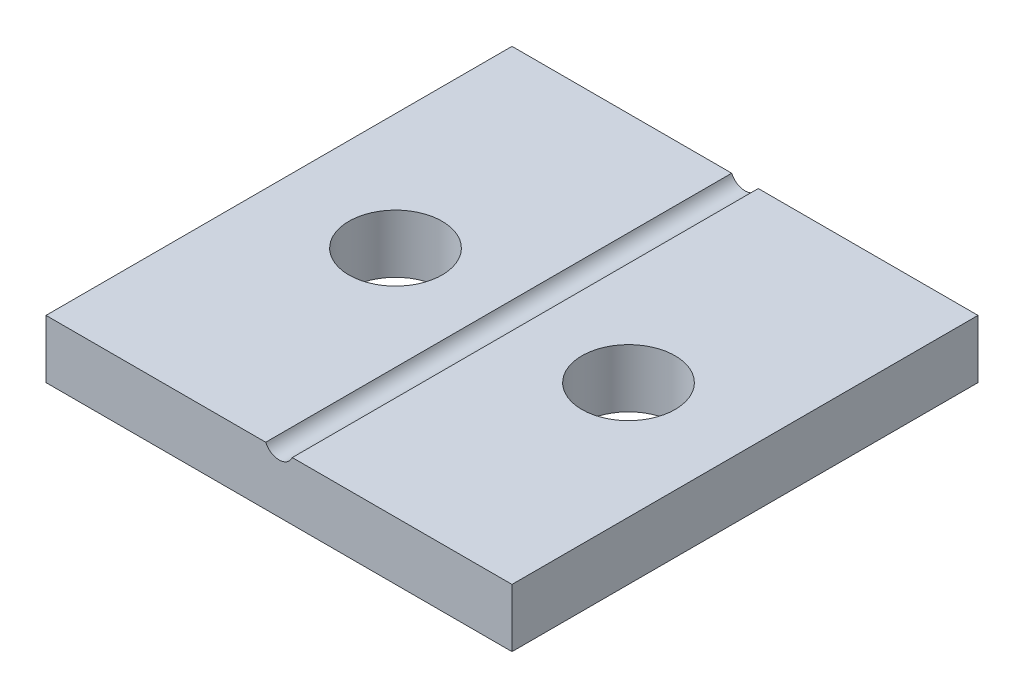
ISO-10303-21;
HEADER;
FILE_DESCRIPTION(('STEP AP214'),'2;1');
FILE_NAME('part.step','',(''),(''),'','','');
FILE_SCHEMA(('AUTOMOTIVE_DESIGN { 1 0 10303 214 1 1 1 1 }'));
ENDSEC;
DATA;
#1=APPLICATION_CONTEXT('core data for automotive mechanical design processes');
#2=APPLICATION_PROTOCOL_DEFINITION('international standard','automotive_design',2000,#1);
#3=PRODUCT_CONTEXT('',#1,'mechanical');
#4=PRODUCT('Part','Part','',(#3));
#5=PRODUCT_RELATED_PRODUCT_CATEGORY('part','',(#4));
#6=PRODUCT_DEFINITION_FORMATION('','',#4);
#7=PRODUCT_DEFINITION_CONTEXT('part definition',#1,'design');
#8=PRODUCT_DEFINITION('design','',#6,#7);
#9=PRODUCT_DEFINITION_SHAPE('','',#8);
#10=(LENGTH_UNIT() NAMED_UNIT(*) SI_UNIT(.MILLI.,.METRE.));
#11=(NAMED_UNIT(*) PLANE_ANGLE_UNIT() SI_UNIT($,.RADIAN.));
#12=(NAMED_UNIT(*) SI_UNIT($,.STERADIAN.) SOLID_ANGLE_UNIT());
#13=UNCERTAINTY_MEASURE_WITH_UNIT(LENGTH_MEASURE(1.E-05),#10,'distance_accuracy_value','');
#14=(GEOMETRIC_REPRESENTATION_CONTEXT(3) GLOBAL_UNCERTAINTY_ASSIGNED_CONTEXT((#13)) GLOBAL_UNIT_ASSIGNED_CONTEXT((#10,
#11,#12)) REPRESENTATION_CONTEXT('',''));
#15=CARTESIAN_POINT('',(0.,0.,0.));
#16=DIRECTION('',(0.,0.,1.));
#17=DIRECTION('',(1.,0.,0.));
#18=AXIS2_PLACEMENT_3D('',#15,#16,#17);
#19=CARTESIAN_POINT('',(0.,2.5,0.));
#20=DIRECTION('',(0.,1.,0.));
#21=DIRECTION('',(0.,0.,1.));
#22=AXIS2_PLACEMENT_3D('',#19,#20,#21);
#23=PLANE('',#22);
#24=CARTESIAN_POINT('',(-55.7547169811321,2.5,-42.0754716981132));
#25=DIRECTION('',(0.,1.,0.));
#26=DIRECTION('',(0.,0.,1.));
#27=AXIS2_PLACEMENT_3D('',#24,#25,#26);
#28=CIRCLE('',#27,2.);
#29=CARTESIAN_POINT('',(-55.7547169811321,2.5,-40.0754716981132));
#30=VERTEX_POINT('',#29);
#31=EDGE_CURVE('E170',#30,#30,#28,.T.);
#32=ORIENTED_EDGE('',*,*,#31,.F.);
#33=EDGE_LOOP('',(#32));
#34=FACE_BOUND('',#33,.T.);
#35=DIRECTION('',(0.,0.,1.));
#36=VECTOR('',#35,1.);
#37=CARTESIAN_POINT('',(-51.324591783172,2.5,-52.0754716981132));
#38=LINE('',#37,#36);
#39=CARTESIAN_POINT('',(-51.324591783172,2.5,-52.0754716981132));
#40=VERTEX_POINT('',#39);
#41=CARTESIAN_POINT('',(-51.324591783172,2.5,-32.0754716981132));
#42=VERTEX_POINT('',#41);
#43=EDGE_CURVE('E11',#40,#42,#38,.T.);
#44=ORIENTED_EDGE('',*,*,#43,.F.);
#45=DIRECTION('',(-1.,0.,0.));
#46=VECTOR('',#45,1.);
#47=CARTESIAN_POINT('',(-60.7547169811321,2.5,-52.0754716981132));
#48=LINE('',#47,#46);
#49=CARTESIAN_POINT('',(-60.7547169811321,2.5,-52.0754716981132));
#50=VERTEX_POINT('',#49);
#51=EDGE_CURVE('E56',#40,#50,#48,.T.);
#52=ORIENTED_EDGE('',*,*,#51,.T.);
#53=DIRECTION('',(0.,0.,1.));
#54=VECTOR('',#53,1.);
#55=CARTESIAN_POINT('',(-60.7547169811321,2.5,-52.0754716981132));
#56=LINE('',#55,#54);
#57=CARTESIAN_POINT('',(-60.7547169811321,2.5,-32.0754716981132));
#58=VERTEX_POINT('',#57);
#59=EDGE_CURVE('E103',#50,#58,#56,.T.);
#60=ORIENTED_EDGE('',*,*,#59,.T.);
#61=DIRECTION('',(1.,0.,0.));
#62=VECTOR('',#61,1.);
#63=CARTESIAN_POINT('',(-60.7547169811321,2.5,-32.0754716981132));
#64=LINE('',#63,#62);
#65=EDGE_CURVE('E85',#58,#42,#64,.T.);
#66=ORIENTED_EDGE('',*,*,#65,.T.);
#67=EDGE_LOOP('',(#44,#52,#60,#66));
#68=FACE_BOUND('',#67,.T.);
#69=ADVANCED_FACE('F33',(#34,#68),#23,.T.);
#70=CARTESIAN_POINT('',(-60.7547169811321,2.5,-52.0754716981132));
#71=DIRECTION('',(1.,0.,0.));
#72=DIRECTION('',(0.,0.,-1.));
#73=AXIS2_PLACEMENT_3D('',#70,#71,#72);
#74=PLANE('',#73);
#75=DIRECTION('',(0.,0.,1.));
#76=VECTOR('',#75,1.);
#77=CARTESIAN_POINT('',(-60.7547169811321,0.,-52.0754716981132));
#78=LINE('',#77,#76);
#79=CARTESIAN_POINT('',(-60.7547169811321,0.,-52.0754716981132));
#80=VERTEX_POINT('',#79);
#81=CARTESIAN_POINT('',(-60.7547169811321,0.,-32.0754716981132));
#82=VERTEX_POINT('',#81);
#83=EDGE_CURVE('E114',#80,#82,#78,.T.);
#84=ORIENTED_EDGE('',*,*,#83,.T.);
#85=DIRECTION('',(0.,-1.,0.));
#86=VECTOR('',#85,1.);
#87=CARTESIAN_POINT('',(-60.7547169811321,2.5,-32.0754716981132));
#88=LINE('',#87,#86);
#89=EDGE_CURVE('E128',#58,#82,#88,.T.);
#90=ORIENTED_EDGE('',*,*,#89,.F.);
#91=ORIENTED_EDGE('',*,*,#59,.F.);
#92=DIRECTION('',(0.,-1.,0.));
#93=VECTOR('',#92,1.);
#94=CARTESIAN_POINT('',(-60.7547169811321,2.5,-52.0754716981132));
#95=LINE('',#94,#93);
#96=EDGE_CURVE('E113',#50,#80,#95,.T.);
#97=ORIENTED_EDGE('',*,*,#96,.T.);
#98=EDGE_LOOP('',(#84,#90,#91,#97));
#99=FACE_BOUND('',#98,.T.);
#100=ADVANCED_FACE('F35',(#99),#74,.F.);
#101=CARTESIAN_POINT('',(-60.7547169811321,2.5,-32.0754716981132));
#102=DIRECTION('',(0.,0.,-1.));
#103=DIRECTION('',(-1.,0.,0.));
#104=AXIS2_PLACEMENT_3D('',#101,#102,#103);
#105=PLANE('',#104);
#106=CARTESIAN_POINT('',(-50.1848421790922,2.5,-32.0754716981132));
#107=VERTEX_POINT('',#106);
#108=CARTESIAN_POINT('',(-40.7547169811321,2.5,-32.0754716981132));
#109=VERTEX_POINT('',#108);
#110=EDGE_CURVE('E99',#107,#109,#64,.T.);
#111=ORIENTED_EDGE('',*,*,#110,.F.);
#112=CARTESIAN_POINT('',(-50.7547169811321,2.75,-32.0754716981132));
#113=DIRECTION('',(0.,0.,1.));
#114=DIRECTION('',(1.,0.,0.));
#115=AXIS2_PLACEMENT_3D('',#112,#113,#114);
#116=CIRCLE('',#115,0.622300000000001);
#117=EDGE_CURVE('E47',#42,#107,#116,.T.);
#118=ORIENTED_EDGE('',*,*,#117,.F.);
#119=ORIENTED_EDGE('',*,*,#65,.F.);
#120=ORIENTED_EDGE('',*,*,#89,.T.);
#121=DIRECTION('',(1.,0.,0.));
#122=VECTOR('',#121,1.);
#123=CARTESIAN_POINT('',(-60.7547169811321,0.,-32.0754716981132));
#124=LINE('',#123,#122);
#125=CARTESIAN_POINT('',(-40.7547169811321,0.,-32.0754716981132));
#126=VERTEX_POINT('',#125);
#127=EDGE_CURVE('E117',#82,#126,#124,.T.);
#128=ORIENTED_EDGE('',*,*,#127,.T.);
#129=DIRECTION('',(0.,-1.,0.));
#130=VECTOR('',#129,1.);
#131=CARTESIAN_POINT('',(-40.7547169811321,2.5,-32.0754716981132));
#132=LINE('',#131,#130);
#133=EDGE_CURVE('E125',#109,#126,#132,.T.);
#134=ORIENTED_EDGE('',*,*,#133,.F.);
#135=EDGE_LOOP('',(#111,#118,#119,#120,#128,#134));
#136=FACE_BOUND('',#135,.T.);
#137=ADVANCED_FACE('F97',(#136),#105,.F.);
#138=CARTESIAN_POINT('',(-40.7547169811321,2.5,-52.0754716981132));
#139=DIRECTION('',(-1.,0.,0.));
#140=DIRECTION('',(0.,0.,1.));
#141=AXIS2_PLACEMENT_3D('',#138,#139,#140);
#142=PLANE('',#141);
#143=DIRECTION('',(0.,0.,-1.));
#144=VECTOR('',#143,1.);
#145=CARTESIAN_POINT('',(-40.7547169811321,0.,-52.0754716981132));
#146=LINE('',#145,#144);
#147=CARTESIAN_POINT('',(-40.7547169811321,0.,-52.0754716981132));
#148=VERTEX_POINT('',#147);
#149=EDGE_CURVE('E119',#126,#148,#146,.T.);
#150=ORIENTED_EDGE('',*,*,#149,.T.);
#151=DIRECTION('',(0.,-1.,0.));
#152=VECTOR('',#151,1.);
#153=CARTESIAN_POINT('',(-40.7547169811321,2.5,-52.0754716981132));
#154=LINE('',#153,#152);
#155=CARTESIAN_POINT('',(-40.7547169811321,2.5,-52.0754716981132));
#156=VERTEX_POINT('',#155);
#157=EDGE_CURVE('E123',#156,#148,#154,.T.);
#158=ORIENTED_EDGE('',*,*,#157,.F.);
#159=DIRECTION('',(0.,0.,-1.));
#160=VECTOR('',#159,1.);
#161=CARTESIAN_POINT('',(-40.7547169811321,2.5,-52.0754716981132));
#162=LINE('',#161,#160);
#163=EDGE_CURVE('E105',#109,#156,#162,.T.);
#164=ORIENTED_EDGE('',*,*,#163,.F.);
#165=ORIENTED_EDGE('',*,*,#133,.T.);
#166=EDGE_LOOP('',(#150,#158,#164,#165));
#167=FACE_BOUND('',#166,.T.);
#168=ADVANCED_FACE('F137',(#167),#142,.F.);
#169=CARTESIAN_POINT('',(-60.7547169811321,2.5,-52.0754716981132));
#170=DIRECTION('',(0.,0.,1.));
#171=DIRECTION('',(1.,0.,0.));
#172=AXIS2_PLACEMENT_3D('',#169,#170,#171);
#173=PLANE('',#172);
#174=ORIENTED_EDGE('',*,*,#51,.F.);
#175=CARTESIAN_POINT('',(-50.7547169811321,2.75,-52.0754716981132));
#176=DIRECTION('',(0.,0.,1.));
#177=DIRECTION('',(1.,0.,0.));
#178=AXIS2_PLACEMENT_3D('',#175,#176,#177);
#179=CIRCLE('',#178,0.622300000000001);
#180=CARTESIAN_POINT('',(-50.1848421790922,2.5,-52.0754716981132));
#181=VERTEX_POINT('',#180);
#182=EDGE_CURVE('E95',#40,#181,#179,.T.);
#183=ORIENTED_EDGE('',*,*,#182,.T.);
#184=EDGE_CURVE('E110',#156,#181,#48,.T.);
#185=ORIENTED_EDGE('',*,*,#184,.F.);
#186=ORIENTED_EDGE('',*,*,#157,.T.);
#187=DIRECTION('',(-1.,0.,0.));
#188=VECTOR('',#187,1.);
#189=CARTESIAN_POINT('',(-60.7547169811321,0.,-52.0754716981132));
#190=LINE('',#189,#188);
#191=EDGE_CURVE('E78',#148,#80,#190,.T.);
#192=ORIENTED_EDGE('',*,*,#191,.T.);
#193=ORIENTED_EDGE('',*,*,#96,.F.);
#194=EDGE_LOOP('',(#174,#183,#185,#186,#192,#193));
#195=FACE_BOUND('',#194,.T.);
#196=ADVANCED_FACE('F131',(#195),#173,.F.);
#197=CARTESIAN_POINT('',(-45.7547169811321,2.5,-42.0754716981132));
#198=DIRECTION('',(0.,1.,0.));
#199=DIRECTION('',(0.,0.,1.));
#200=AXIS2_PLACEMENT_3D('',#197,#198,#199);
#201=CIRCLE('',#200,2.);
#202=CARTESIAN_POINT('',(-45.7547169811321,2.5,-40.0754716981132));
#203=VERTEX_POINT('',#202);
#204=EDGE_CURVE('E165',#203,#203,#201,.T.);
#205=ORIENTED_EDGE('',*,*,#204,.F.);
#206=EDGE_LOOP('',(#205));
#207=FACE_BOUND('',#206,.T.);
#208=DIRECTION('',(0.,0.,1.));
#209=VECTOR('',#208,1.);
#210=CARTESIAN_POINT('',(-50.1848421790922,2.5,-52.0754716981132));
#211=LINE('',#210,#209);
#212=EDGE_CURVE('E41',#107,#181,#211,.F.);
#213=ORIENTED_EDGE('',*,*,#212,.F.);
#214=ORIENTED_EDGE('',*,*,#110,.T.);
#215=ORIENTED_EDGE('',*,*,#163,.T.);
#216=ORIENTED_EDGE('',*,*,#184,.T.);
#217=EDGE_LOOP('',(#213,#214,#215,#216));
#218=FACE_BOUND('',#217,.T.);
#219=ADVANCED_FACE('F133',(#207,#218),#23,.T.);
#220=CARTESIAN_POINT('',(0.,0.,0.));
#221=DIRECTION('',(0.,1.,0.));
#222=DIRECTION('',(0.,0.,1.));
#223=AXIS2_PLACEMENT_3D('',#220,#221,#222);
#224=PLANE('',#223);
#225=CARTESIAN_POINT('',(-45.7547169811321,0.,-42.0754716981132));
#226=DIRECTION('',(0.,1.,0.));
#227=DIRECTION('',(0.,0.,1.));
#228=AXIS2_PLACEMENT_3D('',#225,#226,#227);
#229=CIRCLE('',#228,2.);
#230=CARTESIAN_POINT('',(-45.7547169811321,0.,-40.0754716981132));
#231=VERTEX_POINT('',#230);
#232=EDGE_CURVE('E167',#231,#231,#229,.T.);
#233=ORIENTED_EDGE('',*,*,#232,.T.);
#234=EDGE_LOOP('',(#233));
#235=FACE_BOUND('',#234,.T.);
#236=CARTESIAN_POINT('',(-55.7547169811321,0.,-42.0754716981132));
#237=DIRECTION('',(0.,1.,0.));
#238=DIRECTION('',(0.,0.,1.));
#239=AXIS2_PLACEMENT_3D('',#236,#237,#238);
#240=CIRCLE('',#239,2.);
#241=CARTESIAN_POINT('',(-55.7547169811321,0.,-40.0754716981132));
#242=VERTEX_POINT('',#241);
#243=EDGE_CURVE('E100',#242,#242,#240,.T.);
#244=ORIENTED_EDGE('',*,*,#243,.T.);
#245=EDGE_LOOP('',(#244));
#246=FACE_BOUND('',#245,.T.);
#247=ORIENTED_EDGE('',*,*,#83,.F.);
#248=ORIENTED_EDGE('',*,*,#191,.F.);
#249=ORIENTED_EDGE('',*,*,#149,.F.);
#250=ORIENTED_EDGE('',*,*,#127,.F.);
#251=EDGE_LOOP('',(#247,#248,#249,#250));
#252=FACE_BOUND('',#251,.T.);
#253=ADVANCED_FACE('F141',(#235,#246,#252),#224,.F.);
#254=CARTESIAN_POINT('',(-50.7547169811321,2.75,-52.0754716981132));
#255=DIRECTION('',(0.,0.,1.));
#256=DIRECTION('',(1.,0.,0.));
#257=AXIS2_PLACEMENT_3D('',#254,#255,#256);
#258=CYLINDRICAL_SURFACE('',#257,0.622300000000001);
#259=ORIENTED_EDGE('',*,*,#43,.T.);
#260=ORIENTED_EDGE('',*,*,#117,.T.);
#261=ORIENTED_EDGE('',*,*,#212,.T.);
#262=ORIENTED_EDGE('',*,*,#182,.F.);
#263=EDGE_LOOP('',(#259,#260,#261,#262));
#264=FACE_BOUND('',#263,.T.);
#265=ADVANCED_FACE('F93',(#264),#258,.F.);
#266=CARTESIAN_POINT('',(-55.7547169811321,0.,-42.0754716981132));
#267=DIRECTION('',(0.,1.,0.));
#268=DIRECTION('',(0.,0.,1.));
#269=AXIS2_PLACEMENT_3D('',#266,#267,#268);
#270=CYLINDRICAL_SURFACE('',#269,2.);
#271=ORIENTED_EDGE('',*,*,#243,.F.);
#272=EDGE_LOOP('',(#271));
#273=FACE_BOUND('',#272,.T.);
#274=ORIENTED_EDGE('',*,*,#31,.T.);
#275=EDGE_LOOP('',(#274));
#276=FACE_BOUND('',#275,.T.);
#277=ADVANCED_FACE('F177',(#273,#276),#270,.F.);
#278=CARTESIAN_POINT('',(-45.7547169811321,0.,-42.0754716981132));
#279=DIRECTION('',(0.,1.,0.));
#280=DIRECTION('',(0.,0.,1.));
#281=AXIS2_PLACEMENT_3D('',#278,#279,#280);
#282=CYLINDRICAL_SURFACE('',#281,2.);
#283=ORIENTED_EDGE('',*,*,#232,.F.);
#284=EDGE_LOOP('',(#283));
#285=FACE_BOUND('',#284,.T.);
#286=ORIENTED_EDGE('',*,*,#204,.T.);
#287=EDGE_LOOP('',(#286));
#288=FACE_BOUND('',#287,.T.);
#289=ADVANCED_FACE('F179',(#285,#288),#282,.F.);
#290=CLOSED_SHELL('',(#69,#100,#137,#168,#196,#219,#253,#265,#277,#289));
#291=MANIFOLD_SOLID_BREP('B2',#290);
#292=ADVANCED_BREP_SHAPE_REPRESENTATION('',(#18,#291),#14);
#293=SHAPE_DEFINITION_REPRESENTATION(#9,#292);
ENDSEC;
END-ISO-10303-21;
